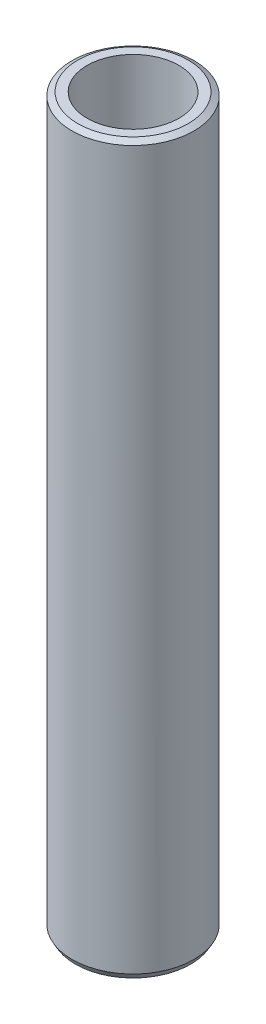
ISO-10303-21;
HEADER;
FILE_DESCRIPTION(('STEP AP214'),'2;1');
FILE_NAME('part.step','',(''),(''),'','','');
FILE_SCHEMA(('AUTOMOTIVE_DESIGN { 1 0 10303 214 1 1 1 1 }'));
ENDSEC;
DATA;
#1=APPLICATION_CONTEXT('core data for automotive mechanical design processes');
#2=APPLICATION_PROTOCOL_DEFINITION('international standard','automotive_design',2000,#1);
#3=PRODUCT_CONTEXT('',#1,'mechanical');
#4=PRODUCT('Part','Part','',(#3));
#5=PRODUCT_RELATED_PRODUCT_CATEGORY('part','',(#4));
#6=PRODUCT_DEFINITION_FORMATION('','',#4);
#7=PRODUCT_DEFINITION_CONTEXT('part definition',#1,'design');
#8=PRODUCT_DEFINITION('design','',#6,#7);
#9=PRODUCT_DEFINITION_SHAPE('','',#8);
#10=(LENGTH_UNIT() NAMED_UNIT(*) SI_UNIT(.MILLI.,.METRE.));
#11=(NAMED_UNIT(*) PLANE_ANGLE_UNIT() SI_UNIT($,.RADIAN.));
#12=(NAMED_UNIT(*) SI_UNIT($,.STERADIAN.) SOLID_ANGLE_UNIT());
#13=UNCERTAINTY_MEASURE_WITH_UNIT(LENGTH_MEASURE(1.E-05),#10,'distance_accuracy_value','');
#14=(GEOMETRIC_REPRESENTATION_CONTEXT(3) GLOBAL_UNCERTAINTY_ASSIGNED_CONTEXT((#13)) GLOBAL_UNIT_ASSIGNED_CONTEXT((#10,
#11,#12)) REPRESENTATION_CONTEXT('',''));
#15=CARTESIAN_POINT('',(0.,0.,0.));
#16=DIRECTION('',(0.,0.,1.));
#17=DIRECTION('',(1.,0.,0.));
#18=AXIS2_PLACEMENT_3D('',#15,#16,#17);
#19=CARTESIAN_POINT('',(0.,446.828968533293,0.));
#20=DIRECTION('',(0.,-1.,0.));
#21=DIRECTION('',(0.,0.,-1.));
#22=AXIS2_PLACEMENT_3D('',#19,#20,#21);
#23=CYLINDRICAL_SURFACE('',#22,37.5);
#24=CARTESIAN_POINT('',(0.,444.756350665672,0.));
#25=DIRECTION('',(0.,1.,0.));
#26=DIRECTION('',(0.,0.,1.));
#27=AXIS2_PLACEMENT_3D('',#24,#25,#26);
#28=CIRCLE('',#27,37.5);
#29=CARTESIAN_POINT('',(0.,444.756350665672,-37.5));
#30=VERTEX_POINT('',#29);
#31=EDGE_CURVE('E50',#30,#30,#28,.F.);
#32=CARTESIAN_POINT('',(0.,3.58987945139677,0.));
#33=DIRECTION('',(0.,1.,0.));
#34=DIRECTION('',(0.,0.,1.));
#35=AXIS2_PLACEMENT_3D('',#32,#33,#34);
#36=CIRCLE('',#35,37.5);
#37=CARTESIAN_POINT('',(0.,3.58987945139677,-37.5));
#38=VERTEX_POINT('',#37);
#39=EDGE_CURVE('E51',#38,#38,#36,.T.);
#40=CARTESIAN_POINT('',(0.,444.756350665672,-37.5));
#41=CARTESIAN_POINT('',(0.,440.160866590523,-37.5));
#42=CARTESIAN_POINT('',(0.,435.565382515374,-37.5));
#43=CARTESIAN_POINT('',(0.,426.374414365077,-37.5));
#44=CARTESIAN_POINT('',(0.,421.778930289928,-37.5));
#45=CARTESIAN_POINT('',(0.,412.587962139631,-37.5));
#46=CARTESIAN_POINT('',(0.,407.992478064482,-37.5));
#47=CARTESIAN_POINT('',(0.,398.801509914185,-37.5));
#48=CARTESIAN_POINT('',(0.,394.206025839036,-37.5));
#49=CARTESIAN_POINT('',(0.,385.015057688738,-37.5));
#50=CARTESIAN_POINT('',(0.,380.41957361359,-37.5));
#51=CARTESIAN_POINT('',(0.,371.228605463292,-37.5));
#52=CARTESIAN_POINT('',(0.,366.633121388144,-37.5));
#53=CARTESIAN_POINT('',(0.,357.442153237846,-37.5));
#54=CARTESIAN_POINT('',(0.,352.846669162698,-37.5));
#55=CARTESIAN_POINT('',(0.,343.6557010124,-37.5));
#56=CARTESIAN_POINT('',(0.,339.060216937251,-37.5));
#57=CARTESIAN_POINT('',(0.,329.869248786954,-37.5));
#58=CARTESIAN_POINT('',(0.,325.273764711805,-37.5));
#59=CARTESIAN_POINT('',(0.,316.082796561508,-37.5));
#60=CARTESIAN_POINT('',(0.,311.487312486359,-37.5));
#61=CARTESIAN_POINT('',(0.,302.296344336062,-37.5));
#62=CARTESIAN_POINT('',(0.,297.700860260913,-37.5));
#63=CARTESIAN_POINT('',(0.,288.509892110616,-37.5));
#64=CARTESIAN_POINT('',(0.,283.914408035467,-37.5));
#65=CARTESIAN_POINT('',(0.,274.72343988517,-37.5));
#66=CARTESIAN_POINT('',(0.,270.127955810021,-37.5));
#67=CARTESIAN_POINT('',(0.,260.936987659724,-37.5));
#68=CARTESIAN_POINT('',(0.,256.341503584575,-37.5));
#69=CARTESIAN_POINT('',(0.,247.150535434278,-37.5));
#70=CARTESIAN_POINT('',(0.,242.555051359129,-37.5));
#71=CARTESIAN_POINT('',(0.,233.364083208831,-37.5));
#72=CARTESIAN_POINT('',(0.,228.768599133683,-37.5));
#73=CARTESIAN_POINT('',(0.,219.577630983385,-37.5));
#74=CARTESIAN_POINT('',(0.,214.982146908237,-37.5));
#75=CARTESIAN_POINT('',(0.,205.791178757939,-37.5));
#76=CARTESIAN_POINT('',(0.,201.195694682791,-37.5));
#77=CARTESIAN_POINT('',(0.,192.004726532493,-37.5));
#78=CARTESIAN_POINT('',(0.,187.409242457345,-37.5));
#79=CARTESIAN_POINT('',(0.,178.218274307047,-37.5));
#80=CARTESIAN_POINT('',(0.,173.622790231898,-37.5));
#81=CARTESIAN_POINT('',(0.,164.431822081601,-37.5));
#82=CARTESIAN_POINT('',(0.,159.836338006452,-37.5));
#83=CARTESIAN_POINT('',(0.,150.645369856155,-37.5));
#84=CARTESIAN_POINT('',(0.,146.049885781006,-37.5));
#85=CARTESIAN_POINT('',(0.,136.858917630709,-37.5));
#86=CARTESIAN_POINT('',(0.,132.26343355556,-37.5));
#87=CARTESIAN_POINT('',(0.,123.072465405263,-37.5));
#88=CARTESIAN_POINT('',(0.,118.476981330114,-37.5));
#89=CARTESIAN_POINT('',(0.,109.286013179817,-37.5));
#90=CARTESIAN_POINT('',(0.,104.690529104668,-37.5));
#91=CARTESIAN_POINT('',(0.,95.4995609543707,-37.5));
#92=CARTESIAN_POINT('',(0.,90.9040768792219,-37.5));
#93=CARTESIAN_POINT('',(0.,81.7131087289245,-37.5));
#94=CARTESIAN_POINT('',(0.,77.1176246537758,-37.5));
#95=CARTESIAN_POINT('',(0.,67.9266565034785,-37.5));
#96=CARTESIAN_POINT('',(0.,63.3311724283298,-37.5));
#97=CARTESIAN_POINT('',(0.,54.1402042780324,-37.5));
#98=CARTESIAN_POINT('',(0.,49.5447202028837,-37.5));
#99=CARTESIAN_POINT('',(0.,40.3537520525863,-37.5));
#100=CARTESIAN_POINT('',(0.,35.7582679774376,-37.5));
#101=CARTESIAN_POINT('',(0.,26.5672998271402,-37.5));
#102=CARTESIAN_POINT('',(0.,21.9718157519915,-37.5));
#103=CARTESIAN_POINT('',(0.,12.7808476016941,-37.5));
#104=CARTESIAN_POINT('',(0.,8.18536352654546,-37.5));
#105=CARTESIAN_POINT('',(0.,3.58987945139677,-37.5));
#106=B_SPLINE_CURVE_WITH_KNOTS('',3,(#40,#41,#42,#43,#44,#45,#46,#47,#48,#49,#50,#51,#52,#53,
#54,#55,#56,#57,#58,#59,#60,#61,#62,#63,#64,#65,#66,#67,#68,#69,#70,#71,#72,#73,#74,#75,#76,#77,
#78,#79,#80,#81,#82,#83,#84,#85,#86,#87,#88,#89,#90,#91,#92,#93,#94,#95,#96,#97,#98,#99,#100,
#101,#102,#103,#104,#105),.UNSPECIFIED.,.F.,.F.,(4,2,2,2,2,2,2,2,2,2,2,2,2,2,2,2,2,2,2,2,2,2,2,
2,2,2,2,2,2,2,2,2,4),(0.,13.7864522254461,27.5729044508922,41.3593566763383,55.1458089017844,
68.9322611272304,82.7187133526766,96.5051655781226,110.291617803569,124.078070029015,
137.864522254461,151.650974479907,165.437426705353,179.223878930799,193.010331156245,
206.796783381691,220.583235607137,234.369687832583,248.15614005803,261.942592283476,
275.729044508922,289.515496734368,303.301948959814,317.08840118526,330.874853410706,
344.661305636152,358.447757861598,372.234210087044,386.02066231249,399.807114537936,
413.593566763383,427.380018988829,441.166471214275),.UNSPECIFIED.);
#107=EDGE_CURVE('BSEAM39',#30,#38,#106,.T.);
#108=ORIENTED_EDGE('',*,*,#31,.T.);
#109=ORIENTED_EDGE('',*,*,#39,.T.);
#110=ORIENTED_EDGE('',*,*,#107,.T.);
#111=ORIENTED_EDGE('',*,*,#107,.F.);
#112=EDGE_LOOP('',(#108,#110,#109,#111));
#113=FACE_BOUND('',#112,.T.);
#114=ADVANCED_FACE('F39',(#113),#23,.T.);
#115=CARTESIAN_POINT('',(0.,446.828968533293,0.));
#116=DIRECTION('',(0.,1.,0.));
#117=DIRECTION('',(0.,0.,1.));
#118=AXIS2_PLACEMENT_3D('',#115,#116,#117);
#119=PLANE('',#118);
#120=CARTESIAN_POINT('',(0.,446.828968533293,0.));
#121=DIRECTION('',(0.,1.,0.));
#122=DIRECTION('',(0.,0.,1.));
#123=AXIS2_PLACEMENT_3D('',#120,#121,#122);
#124=CIRCLE('',#123,33.9101205486043);
#125=CARTESIAN_POINT('',(0.,446.828968533293,33.9101205486043));
#126=VERTEX_POINT('',#125);
#127=EDGE_CURVE('E54',#126,#126,#124,.T.);
#128=ORIENTED_EDGE('',*,*,#127,.T.);
#129=EDGE_LOOP('',(#128));
#130=FACE_BOUND('',#129,.T.);
#131=CARTESIAN_POINT('',(0.,446.828968533293,0.));
#132=DIRECTION('',(0.,1.,0.));
#133=DIRECTION('',(0.,0.,1.));
#134=AXIS2_PLACEMENT_3D('',#131,#132,#133);
#135=CIRCLE('',#134,28.2192548946473);
#136=CARTESIAN_POINT('',(0.,446.828968533293,-28.2192548946473));
#137=VERTEX_POINT('',#136);
#138=EDGE_CURVE('E58',#137,#137,#135,.T.);
#139=ORIENTED_EDGE('',*,*,#138,.F.);
#140=EDGE_LOOP('',(#139));
#141=FACE_BOUND('',#140,.T.);
#142=ADVANCED_FACE('F69',(#130,#141),#119,.T.);
#143=CARTESIAN_POINT('',(0.,0.,0.));
#144=DIRECTION('',(0.,1.,0.));
#145=DIRECTION('',(0.,0.,1.));
#146=AXIS2_PLACEMENT_3D('',#143,#144,#145);
#147=PLANE('',#146);
#148=CARTESIAN_POINT('',(0.,0.,0.));
#149=DIRECTION('',(0.,1.,0.));
#150=DIRECTION('',(0.,0.,1.));
#151=AXIS2_PLACEMENT_3D('',#148,#149,#150);
#152=CIRCLE('',#151,35.4273821323777);
#153=CARTESIAN_POINT('',(0.,0.,35.4273821323777));
#154=VERTEX_POINT('',#153);
#155=EDGE_CURVE('E10',#154,#154,#152,.F.);
#156=ORIENTED_EDGE('',*,*,#155,.T.);
#157=EDGE_LOOP('',(#156));
#158=FACE_BOUND('',#157,.T.);
#159=CARTESIAN_POINT('',(0.,0.,0.));
#160=DIRECTION('',(0.,1.,0.));
#161=DIRECTION('',(0.,0.,1.));
#162=AXIS2_PLACEMENT_3D('',#159,#160,#161);
#163=CIRCLE('',#162,28.2192548946473);
#164=CARTESIAN_POINT('',(0.,0.,-28.2192548946473));
#165=VERTEX_POINT('',#164);
#166=EDGE_CURVE('E63',#165,#165,#163,.T.);
#167=ORIENTED_EDGE('',*,*,#166,.T.);
#168=EDGE_LOOP('',(#167));
#169=FACE_BOUND('',#168,.T.);
#170=ADVANCED_FACE('F75',(#158,#169),#147,.F.);
#171=CARTESIAN_POINT('',(0.,446.828968533293,0.));
#172=DIRECTION('',(0.,-1.,0.));
#173=DIRECTION('',(0.,0.,-1.));
#174=AXIS2_PLACEMENT_3D('',#171,#172,#173);
#175=CYLINDRICAL_SURFACE('',#174,28.2192548946473);
#176=CARTESIAN_POINT('',(0.,446.828968533293,-28.2192548946473));
#177=CARTESIAN_POINT('',(0.,442.174500111071,-28.2192548946473));
#178=CARTESIAN_POINT('',(0.,437.52003168885,-28.2192548946473));
#179=CARTESIAN_POINT('',(0.,428.211094844406,-28.2192548946473));
#180=CARTESIAN_POINT('',(0.,423.556626422184,-28.2192548946473));
#181=CARTESIAN_POINT('',(0.,414.247689577741,-28.2192548946473));
#182=CARTESIAN_POINT('',(0.,409.593221155519,-28.2192548946473));
#183=CARTESIAN_POINT('',(0.,400.284284311075,-28.2192548946473));
#184=CARTESIAN_POINT('',(0.,395.629815888853,-28.2192548946473));
#185=CARTESIAN_POINT('',(0.,386.32087904441,-28.2192548946473));
#186=CARTESIAN_POINT('',(0.,381.666410622188,-28.2192548946473));
#187=CARTESIAN_POINT('',(0.,372.357473777744,-28.2192548946473));
#188=CARTESIAN_POINT('',(0.,367.703005355522,-28.2192548946473));
#189=CARTESIAN_POINT('',(0.,358.394068511079,-28.2192548946473));
#190=CARTESIAN_POINT('',(0.,353.739600088857,-28.2192548946473));
#191=CARTESIAN_POINT('',(0.,344.430663244413,-28.2192548946473));
#192=CARTESIAN_POINT('',(0.,339.776194822192,-28.2192548946473));
#193=CARTESIAN_POINT('',(0.,330.467257977748,-28.2192548946473));
#194=CARTESIAN_POINT('',(0.,325.812789555526,-28.2192548946473));
#195=CARTESIAN_POINT('',(0.,316.503852711083,-28.2192548946473));
#196=CARTESIAN_POINT('',(0.,311.849384288861,-28.2192548946473));
#197=CARTESIAN_POINT('',(0.,302.540447444417,-28.2192548946473));
#198=CARTESIAN_POINT('',(0.,297.885979022195,-28.2192548946473));
#199=CARTESIAN_POINT('',(0.,288.577042177752,-28.2192548946473));
#200=CARTESIAN_POINT('',(0.,283.92257375553,-28.2192548946473));
#201=CARTESIAN_POINT('',(0.,274.613636911086,-28.2192548946473));
#202=CARTESIAN_POINT('',(0.,269.959168488865,-28.2192548946473));
#203=CARTESIAN_POINT('',(0.,260.650231644421,-28.2192548946473));
#204=CARTESIAN_POINT('',(0.,255.995763222199,-28.2192548946473));
#205=CARTESIAN_POINT('',(0.,246.686826377756,-28.2192548946473));
#206=CARTESIAN_POINT('',(0.,242.032357955534,-28.2192548946473));
#207=CARTESIAN_POINT('',(0.,232.72342111109,-28.2192548946473));
#208=CARTESIAN_POINT('',(0.,228.068952688868,-28.2192548946473));
#209=CARTESIAN_POINT('',(0.,218.760015844425,-28.2192548946473));
#210=CARTESIAN_POINT('',(0.,214.105547422203,-28.2192548946473));
#211=CARTESIAN_POINT('',(0.,204.796610577759,-28.2192548946473));
#212=CARTESIAN_POINT('',(0.,200.142142155538,-28.2192548946473));
#213=CARTESIAN_POINT('',(0.,190.833205311094,-28.2192548946473));
#214=CARTESIAN_POINT('',(0.,186.178736888872,-28.2192548946473));
#215=CARTESIAN_POINT('',(0.,176.869800044429,-28.2192548946473));
#216=CARTESIAN_POINT('',(0.,172.215331622207,-28.2192548946473));
#217=CARTESIAN_POINT('',(0.,162.906394777763,-28.2192548946473));
#218=CARTESIAN_POINT('',(0.,158.251926355541,-28.2192548946473));
#219=CARTESIAN_POINT('',(0.,148.942989511098,-28.2192548946473));
#220=CARTESIAN_POINT('',(0.,144.288521088876,-28.2192548946473));
#221=CARTESIAN_POINT('',(0.,134.979584244432,-28.2192548946473));
#222=CARTESIAN_POINT('',(0.,130.325115822211,-28.2192548946473));
#223=CARTESIAN_POINT('',(0.,121.016178977767,-28.2192548946473));
#224=CARTESIAN_POINT('',(0.,116.361710555545,-28.2192548946473));
#225=CARTESIAN_POINT('',(0.,107.052773711101,-28.2192548946473));
#226=CARTESIAN_POINT('',(0.,102.39830528888,-28.2192548946473));
#227=CARTESIAN_POINT('',(0.,93.0893684444361,-28.2192548946473));
#228=CARTESIAN_POINT('',(0.,88.4349000222143,-28.2192548946473));
#229=CARTESIAN_POINT('',(0.,79.1259631777707,-28.2192548946473));
#230=CARTESIAN_POINT('',(0.,74.4714947555489,-28.2192548946473));
#231=CARTESIAN_POINT('',(0.,65.1625579111053,-28.2192548946473));
#232=CARTESIAN_POINT('',(0.,60.5080894888835,-28.2192548946473));
#233=CARTESIAN_POINT('',(0.,51.1991526444398,-28.2192548946473));
#234=CARTESIAN_POINT('',(0.,46.544684222218,-28.2192548946473));
#235=CARTESIAN_POINT('',(0.,37.2357473777744,-28.2192548946473));
#236=CARTESIAN_POINT('',(0.,32.5812789555526,-28.2192548946473));
#237=CARTESIAN_POINT('',(0.,23.272342111109,-28.2192548946473));
#238=CARTESIAN_POINT('',(0.,18.6178736888872,-28.2192548946473));
#239=CARTESIAN_POINT('',(0.,9.3089368444436,-28.2192548946473));
#240=CARTESIAN_POINT('',(0.,4.6544684222218,-28.2192548946473));
#241=CARTESIAN_POINT('',(0.,0.,-28.2192548946473));
#242=B_SPLINE_CURVE_WITH_KNOTS('',3,(#176,#177,#178,#179,#180,#181,#182,#183,#184,#185,#186,
#187,#188,#189,#190,#191,#192,#193,#194,#195,#196,#197,#198,#199,#200,#201,#202,#203,#204,#205,
#206,#207,#208,#209,#210,#211,#212,#213,#214,#215,#216,#217,#218,#219,#220,#221,#222,#223,#224,
#225,#226,#227,#228,#229,#230,#231,#232,#233,#234,#235,#236,#237,#238,#239,#240,#241),
.UNSPECIFIED.,.F.,.F.,(4,2,2,2,2,2,2,2,2,2,2,2,2,2,2,2,2,2,2,2,2,2,2,2,2,2,2,2,2,2,2,2,4),(0.,
13.9634052666655,27.9268105333308,41.8902157999962,55.8536210666617,69.8170263333271,
83.7804315999925,97.7438368666579,111.707242133323,125.670647399989,139.634052666654,
153.59745793332,167.560863199985,181.52426846665,195.487673733316,209.451078999981,
223.414484266647,237.377889533312,251.341294799977,265.304700066643,279.268105333308,
293.231510599974,307.194915866639,321.158321133304,335.12172639997,349.085131666635,
363.048536933301,377.011942199966,390.975347466632,404.938752733297,418.902157999962,
432.865563266628,446.828968533293),.UNSPECIFIED.);
#243=EDGE_CURVE('BSEAM70',#137,#165,#242,.T.);
#244=ORIENTED_EDGE('',*,*,#138,.T.);
#245=ORIENTED_EDGE('',*,*,#166,.F.);
#246=ORIENTED_EDGE('',*,*,#243,.T.);
#247=ORIENTED_EDGE('',*,*,#243,.F.);
#248=EDGE_LOOP('',(#244,#246,#245,#247));
#249=FACE_BOUND('',#248,.T.);
#250=ADVANCED_FACE('F70',(#249),#175,.F.);
#251=CARTESIAN_POINT('',(0.,446.828968533293,0.));
#252=DIRECTION('',(0.,-1.,0.));
#253=DIRECTION('',(0.,0.,-1.));
#254=AXIS2_PLACEMENT_3D('',#251,#252,#253);
#255=CONICAL_SURFACE('',#254,33.9101205486043,1.04719755119659);
#256=ORIENTED_EDGE('',*,*,#31,.F.);
#257=EDGE_LOOP('',(#256));
#258=FACE_BOUND('',#257,.T.);
#259=ORIENTED_EDGE('',*,*,#127,.F.);
#260=EDGE_LOOP('',(#259));
#261=FACE_BOUND('',#260,.T.);
#262=ADVANCED_FACE('F81',(#258,#261),#255,.T.);
#263=CARTESIAN_POINT('',(0.,3.58987945139677,0.));
#264=DIRECTION('',(0.,1.,0.));
#265=DIRECTION('',(0.,0.,1.));
#266=AXIS2_PLACEMENT_3D('',#263,#264,#265);
#267=CONICAL_SURFACE('',#266,37.5,0.523598775598306);
#268=ORIENTED_EDGE('',*,*,#155,.F.);
#269=EDGE_LOOP('',(#268));
#270=FACE_BOUND('',#269,.T.);
#271=ORIENTED_EDGE('',*,*,#39,.F.);
#272=EDGE_LOOP('',(#271));
#273=FACE_BOUND('',#272,.T.);
#274=ADVANCED_FACE('F45',(#270,#273),#267,.T.);
#275=CLOSED_SHELL('',(#114,#142,#170,#250,#262,#274));
#276=MANIFOLD_SOLID_BREP('B2',#275);
#277=ADVANCED_BREP_SHAPE_REPRESENTATION('',(#18,#276),#14);
#278=SHAPE_DEFINITION_REPRESENTATION(#9,#277);
ENDSEC;
END-ISO-10303-21;
